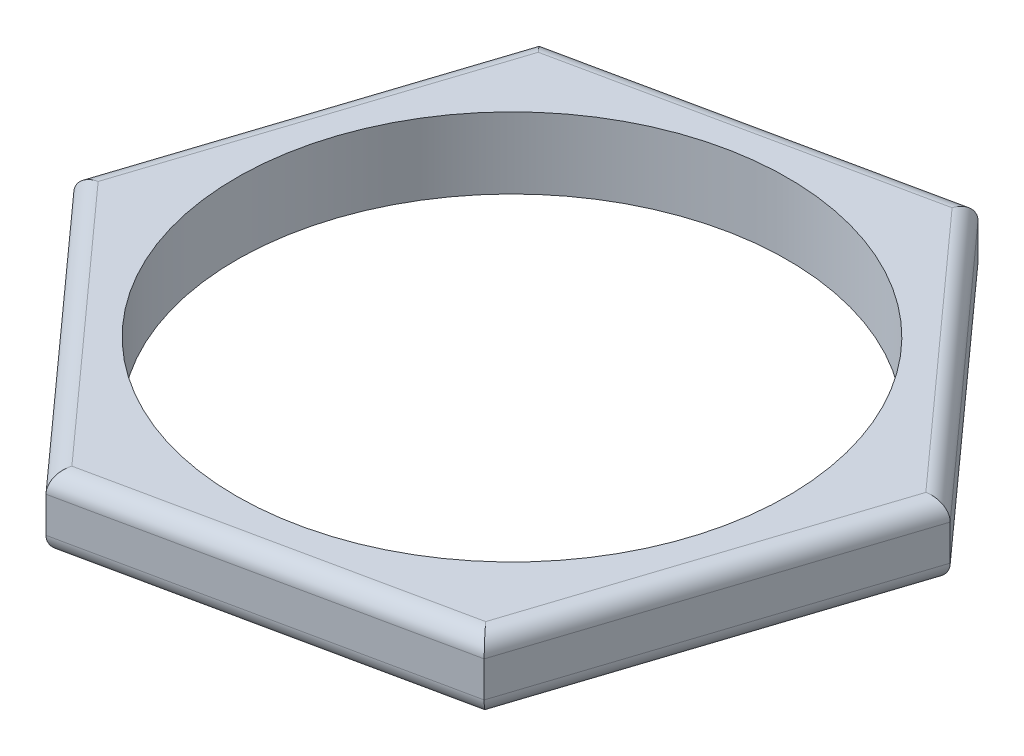
ISO-10303-21;
HEADER;
FILE_DESCRIPTION(('STEP AP214'),'2;1');
FILE_NAME('part.step','',(''),(''),'','','');
FILE_SCHEMA(('AUTOMOTIVE_DESIGN { 1 0 10303 214 1 1 1 1 }'));
ENDSEC;
DATA;
#1=APPLICATION_CONTEXT('core data for automotive mechanical design processes');
#2=APPLICATION_PROTOCOL_DEFINITION('international standard','automotive_design',2000,#1);
#3=PRODUCT_CONTEXT('',#1,'mechanical');
#4=PRODUCT('Part','Part','',(#3));
#5=PRODUCT_RELATED_PRODUCT_CATEGORY('part','',(#4));
#6=PRODUCT_DEFINITION_FORMATION('','',#4);
#7=PRODUCT_DEFINITION_CONTEXT('part definition',#1,'design');
#8=PRODUCT_DEFINITION('design','',#6,#7);
#9=PRODUCT_DEFINITION_SHAPE('','',#8);
#10=(LENGTH_UNIT() NAMED_UNIT(*) SI_UNIT(.MILLI.,.METRE.));
#11=(NAMED_UNIT(*) PLANE_ANGLE_UNIT() SI_UNIT($,.RADIAN.));
#12=(NAMED_UNIT(*) SI_UNIT($,.STERADIAN.) SOLID_ANGLE_UNIT());
#13=UNCERTAINTY_MEASURE_WITH_UNIT(LENGTH_MEASURE(1.E-05),#10,'distance_accuracy_value','');
#14=(GEOMETRIC_REPRESENTATION_CONTEXT(3) GLOBAL_UNCERTAINTY_ASSIGNED_CONTEXT((#13)) GLOBAL_UNIT_ASSIGNED_CONTEXT((#10,
#11,#12)) REPRESENTATION_CONTEXT('',''));
#15=CARTESIAN_POINT('',(0.,0.,0.));
#16=DIRECTION('',(0.,0.,1.));
#17=DIRECTION('',(1.,0.,0.));
#18=AXIS2_PLACEMENT_3D('',#15,#16,#17);
#19=CARTESIAN_POINT('',(0.,4.,0.));
#20=DIRECTION('',(0.,1.,0.));
#21=DIRECTION('',(0.,0.,1.));
#22=AXIS2_PLACEMENT_3D('',#19,#20,#21);
#23=PLANE('',#22);
#24=DIRECTION('',(-0.978322792331729,0.,0.207085764851784));
#25=VECTOR('',#24,1.);
#26=CARTESIAN_POINT('',(-13.6874866976076,4.,-14.4793890721541));
#27=LINE('',#26,#25);
#28=CARTESIAN_POINT('',(6.08173576513986,4.,-18.6640248450422));
#29=VERTEX_POINT('',#28);
#30=CARTESIAN_POINT('',(-13.1226517701005,4.,-14.5989500942366));
#31=VERTEX_POINT('',#30);
#32=EDGE_CURVE('E251',#29,#31,#27,.T.);
#33=ORIENTED_EDGE('',*,*,#32,.T.);
#34=DIRECTION('',(-0.309819863042089,0.,0.950795273686498));
#35=VECTOR('',#34,1.);
#36=CARTESIAN_POINT('',(-19.383262116568,4.,4.61401665801271));
#37=LINE('',#36,#35);
#38=CARTESIAN_POINT('',(-19.2043875352404,4.,4.06507475080559));
#39=VERTEX_POINT('',#38);
#40=EDGE_CURVE('E11',#31,#39,#37,.T.);
#41=ORIENTED_EDGE('',*,*,#40,.T.);
#42=DIRECTION('',(0.66850292928964,0.,0.743709508834713));
#43=VECTOR('',#42,1.);
#44=CARTESIAN_POINT('',(-5.69577541896042,4.,19.0934057301668));
#45=LINE('',#44,#43);
#46=CARTESIAN_POINT('',(-6.08173576513985,4.,18.6640248450422));
#47=VERTEX_POINT('',#46);
#48=EDGE_CURVE('E43',#39,#47,#45,.T.);
#49=ORIENTED_EDGE('',*,*,#48,.T.);
#50=DIRECTION('',(0.978322792331729,0.,-0.207085764851784));
#51=VECTOR('',#50,1.);
#52=CARTESIAN_POINT('',(13.6874866976076,4.,14.4793890721541));
#53=LINE('',#52,#51);
#54=CARTESIAN_POINT('',(13.1226517701005,4.,14.5989500942366));
#55=VERTEX_POINT('',#54);
#56=EDGE_CURVE('E257',#47,#55,#53,.T.);
#57=ORIENTED_EDGE('',*,*,#56,.T.);
#58=DIRECTION('',(0.309819863042089,0.,-0.950795273686497));
#59=VECTOR('',#58,1.);
#60=CARTESIAN_POINT('',(19.383262116568,4.,-4.61401665801271));
#61=LINE('',#60,#59);
#62=CARTESIAN_POINT('',(19.2043875352404,4.,-4.06507475080558));
#63=VERTEX_POINT('',#62);
#64=EDGE_CURVE('E255',#55,#63,#61,.T.);
#65=ORIENTED_EDGE('',*,*,#64,.T.);
#66=DIRECTION('',(-0.66850292928964,0.,-0.743709508834713));
#67=VECTOR('',#66,1.);
#68=CARTESIAN_POINT('',(5.69577541896043,4.,-19.0934057301668));
#69=LINE('',#68,#67);
#70=EDGE_CURVE('E253',#63,#29,#69,.T.);
#71=ORIENTED_EDGE('',*,*,#70,.T.);
#72=EDGE_LOOP('',(#33,#41,#49,#57,#65,#71));
#73=FACE_BOUND('',#72,.T.);
#74=CARTESIAN_POINT('',(0.,4.,0.));
#75=DIRECTION('',(0.,1.,0.));
#76=DIRECTION('',(0.,0.,1.));
#77=AXIS2_PLACEMENT_3D('',#74,#75,#76);
#78=CIRCLE('',#77,15.5);
#79=CARTESIAN_POINT('',(0.,4.,15.5));
#80=VERTEX_POINT('',#79);
#81=EDGE_CURVE('E204',#80,#80,#78,.T.);
#82=ORIENTED_EDGE('',*,*,#81,.F.);
#83=EDGE_LOOP('',(#82));
#84=FACE_BOUND('',#83,.T.);
#85=ADVANCED_FACE('F34',(#73,#84),#23,.T.);
#86=CARTESIAN_POINT('',(0.,0.,0.));
#87=DIRECTION('',(0.,1.,0.));
#88=DIRECTION('',(0.,0.,1.));
#89=AXIS2_PLACEMENT_3D('',#86,#87,#88);
#90=PLANE('',#89);
#91=DIRECTION('',(0.66850292928964,0.,0.743709508834713));
#92=VECTOR('',#91,1.);
#93=CARTESIAN_POINT('',(-12.6430616501901,0.,11.3645497979239));
#94=LINE('',#93,#92);
#95=CARTESIAN_POINT('',(-6.08173576513985,0.,18.6640248450422));
#96=VERTEX_POINT('',#95);
#97=CARTESIAN_POINT('',(-19.2043875352404,0.,4.06507475080558));
#98=VERTEX_POINT('',#97);
#99=EDGE_CURVE('E230',#96,#98,#94,.F.);
#100=ORIENTED_EDGE('',*,*,#99,.T.);
#101=DIRECTION('',(-0.309819863042089,0.,0.950795273686498));
#102=VECTOR('',#101,1.);
#103=CARTESIAN_POINT('',(-16.1635196526704,0.,-5.26693767171551));
#104=LINE('',#103,#102);
#105=CARTESIAN_POINT('',(-13.1226517701005,0.,-14.5989500942366));
#106=VERTEX_POINT('',#105);
#107=EDGE_CURVE('E136',#98,#106,#104,.F.);
#108=ORIENTED_EDGE('',*,*,#107,.T.);
#109=DIRECTION('',(-0.978322792331729,0.,0.207085764851784));
#110=VECTOR('',#109,1.);
#111=CARTESIAN_POINT('',(-3.52045800248033,0.,-16.6314874696394));
#112=LINE('',#111,#110);
#113=CARTESIAN_POINT('',(6.08173576513986,0.,-18.6640248450422));
#114=VERTEX_POINT('',#113);
#115=EDGE_CURVE('E222',#106,#114,#112,.F.);
#116=ORIENTED_EDGE('',*,*,#115,.T.);
#117=DIRECTION('',(-0.66850292928964,0.,-0.743709508834713));
#118=VECTOR('',#117,1.);
#119=CARTESIAN_POINT('',(12.6430616501901,0.,-11.3645497979239));
#120=LINE('',#119,#118);
#121=CARTESIAN_POINT('',(19.2043875352404,0.,-4.06507475080558));
#122=VERTEX_POINT('',#121);
#123=EDGE_CURVE('E224',#114,#122,#120,.F.);
#124=ORIENTED_EDGE('',*,*,#123,.T.);
#125=DIRECTION('',(0.309819863042089,0.,-0.950795273686497));
#126=VECTOR('',#125,1.);
#127=CARTESIAN_POINT('',(16.1635196526705,0.,5.2669376717155));
#128=LINE('',#127,#126);
#129=CARTESIAN_POINT('',(13.1226517701005,0.,14.5989500942366));
#130=VERTEX_POINT('',#129);
#131=EDGE_CURVE('E226',#122,#130,#128,.F.);
#132=ORIENTED_EDGE('',*,*,#131,.T.);
#133=DIRECTION('',(0.978322792331729,0.,-0.207085764851784));
#134=VECTOR('',#133,1.);
#135=CARTESIAN_POINT('',(3.52045800248033,0.,16.6314874696394));
#136=LINE('',#135,#134);
#137=EDGE_CURVE('E228',#130,#96,#136,.F.);
#138=ORIENTED_EDGE('',*,*,#137,.T.);
#139=EDGE_LOOP('',(#100,#108,#116,#124,#132,#138));
#140=FACE_BOUND('',#139,.T.);
#141=CARTESIAN_POINT('',(0.,0.,0.));
#142=DIRECTION('',(0.,1.,0.));
#143=DIRECTION('',(0.,0.,1.));
#144=AXIS2_PLACEMENT_3D('',#141,#142,#143);
#145=CIRCLE('',#144,15.5);
#146=CARTESIAN_POINT('',(0.,0.,15.5));
#147=VERTEX_POINT('',#146);
#148=EDGE_CURVE('E198',#147,#147,#145,.T.);
#149=ORIENTED_EDGE('',*,*,#148,.T.);
#150=EDGE_LOOP('',(#149));
#151=FACE_BOUND('',#150,.T.);
#152=ADVANCED_FACE('F292',(#140,#151),#90,.F.);
#153=CARTESIAN_POINT('',(-6.43948492779514,4.,19.7619086594564));
#154=DIRECTION('',(-0.207085764851784,0.,-0.978322792331729));
#155=DIRECTION('',(-0.978322792331729,0.,0.207085764851784));
#156=AXIS2_PLACEMENT_3D('',#153,#154,#155);
#157=PLANE('',#156);
#158=DIRECTION('',(0.,-1.,0.));
#159=VECTOR('',#158,1.);
#160=CARTESIAN_POINT('',(-6.43948492779514,4.,19.7619086594564));
#161=LINE('',#160,#159);
#162=CARTESIAN_POINT('',(-6.43948492779514,3.,19.7619086594564));
#163=VERTEX_POINT('',#162);
#164=CARTESIAN_POINT('',(-6.43948492779514,1.,19.7619086594564));
#165=VERTEX_POINT('',#164);
#166=EDGE_CURVE('E131',#163,#165,#161,.T.);
#167=ORIENTED_EDGE('',*,*,#166,.T.);
#168=DIRECTION('',(0.978322792331729,0.,-0.207085764851784));
#169=VECTOR('',#168,1.);
#170=CARTESIAN_POINT('',(-6.43948492779514,1.,19.7619086594564));
#171=LINE('',#170,#169);
#172=CARTESIAN_POINT('',(13.8945724624594,1.,15.4577118644858));
#173=VERTEX_POINT('',#172);
#174=EDGE_CURVE('E237',#165,#173,#171,.T.);
#175=ORIENTED_EDGE('',*,*,#174,.T.);
#176=DIRECTION('',(0.,-1.,0.));
#177=VECTOR('',#176,1.);
#178=CARTESIAN_POINT('',(13.8945724624594,4.,15.4577118644858));
#179=LINE('',#178,#177);
#180=CARTESIAN_POINT('',(13.8945724624594,3.,15.4577118644858));
#181=VERTEX_POINT('',#180);
#182=EDGE_CURVE('E153',#181,#173,#179,.T.);
#183=ORIENTED_EDGE('',*,*,#182,.F.);
#184=DIRECTION('',(0.978322792331729,0.,-0.207085764851784));
#185=VECTOR('',#184,1.);
#186=CARTESIAN_POINT('',(-6.43948492779514,3.,19.7619086594564));
#187=LINE('',#186,#185);
#188=EDGE_CURVE('E235',#181,#163,#187,.F.);
#189=ORIENTED_EDGE('',*,*,#188,.T.);
#190=EDGE_LOOP('',(#167,#175,#183,#189));
#191=FACE_BOUND('',#190,.T.);
#192=ADVANCED_FACE('F297',(#191),#157,.F.);
#193=CARTESIAN_POINT('',(13.8945724624594,4.,15.4577118644858));
#194=DIRECTION('',(-0.950795273686497,0.,-0.309819863042089));
#195=DIRECTION('',(-0.309819863042089,0.,0.950795273686497));
#196=AXIS2_PLACEMENT_3D('',#193,#194,#195);
#197=PLANE('',#196);
#198=ORIENTED_EDGE('',*,*,#182,.T.);
#199=DIRECTION('',(0.309819863042089,0.,-0.950795273686497));
#200=VECTOR('',#199,1.);
#201=CARTESIAN_POINT('',(13.8945724624594,1.,15.4577118644858));
#202=LINE('',#201,#200);
#203=CARTESIAN_POINT('',(20.3340573902545,1.,-4.30419679497062));
#204=VERTEX_POINT('',#203);
#205=EDGE_CURVE('E241',#173,#204,#202,.T.);
#206=ORIENTED_EDGE('',*,*,#205,.T.);
#207=DIRECTION('',(0.,-1.,0.));
#208=VECTOR('',#207,1.);
#209=CARTESIAN_POINT('',(20.3340573902545,4.,-4.30419679497062));
#210=LINE('',#209,#208);
#211=CARTESIAN_POINT('',(20.3340573902545,3.,-4.30419679497062));
#212=VERTEX_POINT('',#211);
#213=EDGE_CURVE('E216',#212,#204,#210,.T.);
#214=ORIENTED_EDGE('',*,*,#213,.F.);
#215=DIRECTION('',(0.309819863042089,0.,-0.950795273686497));
#216=VECTOR('',#215,1.);
#217=CARTESIAN_POINT('',(13.8945724624594,3.,15.4577118644858));
#218=LINE('',#217,#216);
#219=EDGE_CURVE('E239',#212,#181,#218,.F.);
#220=ORIENTED_EDGE('',*,*,#219,.T.);
#221=EDGE_LOOP('',(#198,#206,#214,#220));
#222=FACE_BOUND('',#221,.T.);
#223=ADVANCED_FACE('F311',(#222),#197,.F.);
#224=CARTESIAN_POINT('',(20.3340573902545,4.,-4.30419679497062));
#225=DIRECTION('',(-0.743709508834713,0.,0.66850292928964));
#226=DIRECTION('',(0.66850292928964,0.,0.743709508834713));
#227=AXIS2_PLACEMENT_3D('',#224,#225,#226);
#228=PLANE('',#227);
#229=ORIENTED_EDGE('',*,*,#213,.T.);
#230=DIRECTION('',(-0.66850292928964,0.,-0.743709508834713));
#231=VECTOR('',#230,1.);
#232=CARTESIAN_POINT('',(20.3340573902545,1.,-4.30419679497062));
#233=LINE('',#232,#231);
#234=CARTESIAN_POINT('',(6.43948492779514,1.,-19.7619086594564));
#235=VERTEX_POINT('',#234);
#236=EDGE_CURVE('E245',#204,#235,#233,.T.);
#237=ORIENTED_EDGE('',*,*,#236,.T.);
#238=DIRECTION('',(0.,-1.,0.));
#239=VECTOR('',#238,1.);
#240=CARTESIAN_POINT('',(6.43948492779514,4.,-19.7619086594564));
#241=LINE('',#240,#239);
#242=CARTESIAN_POINT('',(6.43948492779514,3.,-19.7619086594564));
#243=VERTEX_POINT('',#242);
#244=EDGE_CURVE('E213',#243,#235,#241,.T.);
#245=ORIENTED_EDGE('',*,*,#244,.F.);
#246=DIRECTION('',(-0.66850292928964,0.,-0.743709508834713));
#247=VECTOR('',#246,1.);
#248=CARTESIAN_POINT('',(20.3340573902545,3.,-4.30419679497062));
#249=LINE('',#248,#247);
#250=EDGE_CURVE('E243',#243,#212,#249,.F.);
#251=ORIENTED_EDGE('',*,*,#250,.T.);
#252=EDGE_LOOP('',(#229,#237,#245,#251));
#253=FACE_BOUND('',#252,.T.);
#254=ADVANCED_FACE('F272',(#253),#228,.F.);
#255=CARTESIAN_POINT('',(6.43948492779514,4.,-19.7619086594564));
#256=DIRECTION('',(0.207085764851784,0.,0.978322792331729));
#257=DIRECTION('',(0.978322792331729,0.,-0.207085764851784));
#258=AXIS2_PLACEMENT_3D('',#255,#256,#257);
#259=PLANE('',#258);
#260=ORIENTED_EDGE('',*,*,#244,.T.);
#261=DIRECTION('',(-0.978322792331729,0.,0.207085764851784));
#262=VECTOR('',#261,1.);
#263=CARTESIAN_POINT('',(6.43948492779514,1.,-19.7619086594564));
#264=LINE('',#263,#262);
#265=CARTESIAN_POINT('',(-13.8945724624594,1.,-15.4577118644858));
#266=VERTEX_POINT('',#265);
#267=EDGE_CURVE('E249',#235,#266,#264,.T.);
#268=ORIENTED_EDGE('',*,*,#267,.T.);
#269=DIRECTION('',(0.,-1.,0.));
#270=VECTOR('',#269,1.);
#271=CARTESIAN_POINT('',(-13.8945724624594,4.,-15.4577118644858));
#272=LINE('',#271,#270);
#273=CARTESIAN_POINT('',(-13.8945724624594,3.,-15.4577118644858));
#274=VERTEX_POINT('',#273);
#275=EDGE_CURVE('E147',#274,#266,#272,.T.);
#276=ORIENTED_EDGE('',*,*,#275,.F.);
#277=DIRECTION('',(-0.978322792331729,0.,0.207085764851784));
#278=VECTOR('',#277,1.);
#279=CARTESIAN_POINT('',(6.43948492779515,3.,-19.7619086594564));
#280=LINE('',#279,#278);
#281=EDGE_CURVE('E247',#274,#243,#280,.F.);
#282=ORIENTED_EDGE('',*,*,#281,.T.);
#283=EDGE_LOOP('',(#260,#268,#276,#282));
#284=FACE_BOUND('',#283,.T.);
#285=ADVANCED_FACE('F269',(#284),#259,.F.);
#286=CARTESIAN_POINT('',(-13.8945724624594,4.,-15.4577118644858));
#287=DIRECTION('',(0.950795273686497,0.,0.309819863042089));
#288=DIRECTION('',(0.309819863042089,0.,-0.950795273686498));
#289=AXIS2_PLACEMENT_3D('',#286,#287,#288);
#290=PLANE('',#289);
#291=ORIENTED_EDGE('',*,*,#275,.T.);
#292=DIRECTION('',(-0.309819863042089,0.,0.950795273686498));
#293=VECTOR('',#292,1.);
#294=CARTESIAN_POINT('',(-13.8945724624594,1.,-15.4577118644858));
#295=LINE('',#294,#293);
#296=CARTESIAN_POINT('',(-20.3340573902545,1.,4.30419679497062));
#297=VERTEX_POINT('',#296);
#298=EDGE_CURVE('E146',#266,#297,#295,.T.);
#299=ORIENTED_EDGE('',*,*,#298,.T.);
#300=DIRECTION('',(0.,-1.,0.));
#301=VECTOR('',#300,1.);
#302=CARTESIAN_POINT('',(-20.3340573902545,4.,4.30419679497062));
#303=LINE('',#302,#301);
#304=CARTESIAN_POINT('',(-20.3340573902545,3.,4.30419679497062));
#305=VERTEX_POINT('',#304);
#306=EDGE_CURVE('E129',#305,#297,#303,.T.);
#307=ORIENTED_EDGE('',*,*,#306,.F.);
#308=DIRECTION('',(-0.309819863042089,0.,0.950795273686498));
#309=VECTOR('',#308,1.);
#310=CARTESIAN_POINT('',(-13.8945724624594,3.,-15.4577118644858));
#311=LINE('',#310,#309);
#312=EDGE_CURVE('E143',#305,#274,#311,.F.);
#313=ORIENTED_EDGE('',*,*,#312,.T.);
#314=EDGE_LOOP('',(#291,#299,#307,#313));
#315=FACE_BOUND('',#314,.T.);
#316=ADVANCED_FACE('F142',(#315),#290,.F.);
#317=CARTESIAN_POINT('',(-20.3340573902545,4.,4.30419679497062));
#318=DIRECTION('',(0.743709508834713,0.,-0.66850292928964));
#319=DIRECTION('',(-0.66850292928964,0.,-0.743709508834713));
#320=AXIS2_PLACEMENT_3D('',#317,#318,#319);
#321=PLANE('',#320);
#322=ORIENTED_EDGE('',*,*,#306,.T.);
#323=DIRECTION('',(0.66850292928964,0.,0.743709508834713));
#324=VECTOR('',#323,1.);
#325=CARTESIAN_POINT('',(-20.3340573902545,1.,4.30419679497062));
#326=LINE('',#325,#324);
#327=EDGE_CURVE('E135',#297,#165,#326,.T.);
#328=ORIENTED_EDGE('',*,*,#327,.T.);
#329=ORIENTED_EDGE('',*,*,#166,.F.);
#330=DIRECTION('',(0.66850292928964,0.,0.743709508834713));
#331=VECTOR('',#330,1.);
#332=CARTESIAN_POINT('',(-20.3340573902545,3.,4.30419679497061));
#333=LINE('',#332,#331);
#334=EDGE_CURVE('E126',#163,#305,#333,.F.);
#335=ORIENTED_EDGE('',*,*,#334,.T.);
#336=EDGE_LOOP('',(#322,#328,#329,#335));
#337=FACE_BOUND('',#336,.T.);
#338=ADVANCED_FACE('F128',(#337),#321,.F.);
#339=CARTESIAN_POINT('',(0.,4.,0.));
#340=DIRECTION('',(0.,-1.,0.));
#341=DIRECTION('',(0.,0.,-1.));
#342=AXIS2_PLACEMENT_3D('',#339,#340,#341);
#343=CYLINDRICAL_SURFACE('',#342,15.5);
#344=ORIENTED_EDGE('',*,*,#81,.T.);
#345=EDGE_LOOP('',(#344));
#346=FACE_BOUND('',#345,.T.);
#347=ORIENTED_EDGE('',*,*,#148,.F.);
#348=EDGE_LOOP('',(#347));
#349=FACE_BOUND('',#348,.T.);
#350=ADVANCED_FACE('F301',(#346,#349),#343,.F.);
#351=CARTESIAN_POINT('',(12.9437771887729,1.,15.1478920014437));
#352=DIRECTION('',(0.309819863042089,0.,-0.950795273686497));
#353=DIRECTION('',(-0.950795273686497,0.,-0.309819863042089));
#354=AXIS2_PLACEMENT_3D('',#351,#352,#353);
#355=CYLINDRICAL_SURFACE('',#354,1.);
#356=CARTESIAN_POINT('',(13.1226517701005,1.,14.5989500942366));
#357=DIRECTION('',(0.743709508834713,0.,-0.668502929289641));
#358=DIRECTION('',(-0.668502929289641,0.,-0.743709508834713));
#359=AXIS2_PLACEMENT_3D('',#356,#357,#358);
#360=ELLIPSE('',#359,1.15470053837925,1.);
#361=EDGE_CURVE('E191',#130,#173,#360,.F.);
#362=ORIENTED_EDGE('',*,*,#361,.F.);
#363=ORIENTED_EDGE('',*,*,#131,.F.);
#364=CARTESIAN_POINT('',(19.2043875352404,1.,-4.06507475080558));
#365=DIRECTION('',(-0.207085764851784,0.,-0.978322792331729));
#366=DIRECTION('',(-0.978322792331729,0.,0.207085764851784));
#367=AXIS2_PLACEMENT_3D('',#364,#365,#366);
#368=ELLIPSE('',#367,1.15470053837925,1.);
#369=EDGE_CURVE('E160',#204,#122,#368,.T.);
#370=ORIENTED_EDGE('',*,*,#369,.F.);
#371=ORIENTED_EDGE('',*,*,#205,.F.);
#372=EDGE_LOOP('',(#362,#363,#370,#371));
#373=FACE_BOUND('',#372,.T.);
#374=ADVANCED_FACE('F325',(#373),#355,.T.);
#375=CARTESIAN_POINT('',(19.5903478814198,1.,-3.63569386568098));
#376=DIRECTION('',(-0.66850292928964,0.,-0.743709508834713));
#377=DIRECTION('',(-0.743709508834713,0.,0.66850292928964));
#378=AXIS2_PLACEMENT_3D('',#375,#376,#377);
#379=CYLINDRICAL_SURFACE('',#378,1.);
#380=ORIENTED_EDGE('',*,*,#369,.T.);
#381=ORIENTED_EDGE('',*,*,#123,.F.);
#382=CARTESIAN_POINT('',(6.08173576513986,1.,-18.6640248450422));
#383=DIRECTION('',(-0.950795273686497,0.,-0.309819863042089));
#384=DIRECTION('',(-0.309819863042089,0.,0.950795273686497));
#385=AXIS2_PLACEMENT_3D('',#382,#383,#384);
#386=ELLIPSE('',#385,1.15470053837925,1.);
#387=EDGE_CURVE('E189',#235,#114,#386,.T.);
#388=ORIENTED_EDGE('',*,*,#387,.F.);
#389=ORIENTED_EDGE('',*,*,#236,.F.);
#390=EDGE_LOOP('',(#380,#381,#388,#389));
#391=FACE_BOUND('',#390,.T.);
#392=ADVANCED_FACE('F274',(#391),#379,.T.);
#393=CARTESIAN_POINT('',(-6.64657069264692,1.,18.7835858671247));
#394=DIRECTION('',(0.978322792331729,0.,-0.207085764851784));
#395=DIRECTION('',(-0.207085764851784,0.,-0.978322792331729));
#396=AXIS2_PLACEMENT_3D('',#393,#394,#395);
#397=CYLINDRICAL_SURFACE('',#396,1.);
#398=ORIENTED_EDGE('',*,*,#361,.T.);
#399=ORIENTED_EDGE('',*,*,#174,.F.);
#400=CARTESIAN_POINT('',(-6.08173576513985,1.,18.6640248450422));
#401=DIRECTION('',(0.950795273686498,0.,0.309819863042089));
#402=DIRECTION('',(0.309819863042089,0.,-0.950795273686497));
#403=AXIS2_PLACEMENT_3D('',#400,#401,#402);
#404=ELLIPSE('',#403,1.15470053837925,1.);
#405=EDGE_CURVE('E183',#96,#165,#404,.F.);
#406=ORIENTED_EDGE('',*,*,#405,.F.);
#407=ORIENTED_EDGE('',*,*,#137,.F.);
#408=EDGE_LOOP('',(#398,#399,#406,#407));
#409=FACE_BOUND('',#408,.T.);
#410=ADVANCED_FACE('F320',(#409),#397,.T.);
#411=CARTESIAN_POINT('',(6.64657069264693,1.,-18.7835858671247));
#412=DIRECTION('',(-0.978322792331729,0.,0.207085764851784));
#413=DIRECTION('',(0.207085764851784,0.,0.978322792331729));
#414=AXIS2_PLACEMENT_3D('',#411,#412,#413);
#415=CYLINDRICAL_SURFACE('',#414,1.);
#416=ORIENTED_EDGE('',*,*,#387,.T.);
#417=ORIENTED_EDGE('',*,*,#115,.F.);
#418=CARTESIAN_POINT('',(-13.1226517701005,1.,-14.5989500942366));
#419=DIRECTION('',(-0.743709508834713,0.,0.66850292928964));
#420=DIRECTION('',(-0.66850292928964,0.,-0.743709508834713));
#421=AXIS2_PLACEMENT_3D('',#418,#419,#420);
#422=ELLIPSE('',#421,1.15470053837925,1.);
#423=EDGE_CURVE('E177',#266,#106,#422,.T.);
#424=ORIENTED_EDGE('',*,*,#423,.F.);
#425=ORIENTED_EDGE('',*,*,#267,.F.);
#426=EDGE_LOOP('',(#416,#417,#424,#425));
#427=FACE_BOUND('',#426,.T.);
#428=ADVANCED_FACE('F279',(#427),#415,.T.);
#429=CARTESIAN_POINT('',(-19.5903478814198,1.,3.63569386568098));
#430=DIRECTION('',(0.66850292928964,0.,0.743709508834713));
#431=DIRECTION('',(0.743709508834713,0.,-0.66850292928964));
#432=AXIS2_PLACEMENT_3D('',#429,#430,#431);
#433=CYLINDRICAL_SURFACE('',#432,1.);
#434=ORIENTED_EDGE('',*,*,#405,.T.);
#435=ORIENTED_EDGE('',*,*,#327,.F.);
#436=CARTESIAN_POINT('',(-19.2043875352404,1.,4.06507475080559));
#437=DIRECTION('',(0.207085764851784,0.,0.978322792331729));
#438=DIRECTION('',(0.978322792331729,0.,-0.207085764851784));
#439=AXIS2_PLACEMENT_3D('',#436,#437,#438);
#440=ELLIPSE('',#439,1.15470053837925,1.);
#441=EDGE_CURVE('E172',#98,#297,#440,.F.);
#442=ORIENTED_EDGE('',*,*,#441,.F.);
#443=ORIENTED_EDGE('',*,*,#99,.F.);
#444=EDGE_LOOP('',(#434,#435,#442,#443));
#445=FACE_BOUND('',#444,.T.);
#446=ADVANCED_FACE('F282',(#445),#433,.T.);
#447=CARTESIAN_POINT('',(-12.9437771887729,1.,-15.1478920014437));
#448=DIRECTION('',(-0.309819863042089,0.,0.950795273686498));
#449=DIRECTION('',(0.950795273686497,0.,0.309819863042089));
#450=AXIS2_PLACEMENT_3D('',#447,#448,#449);
#451=CYLINDRICAL_SURFACE('',#450,1.);
#452=ORIENTED_EDGE('',*,*,#423,.T.);
#453=ORIENTED_EDGE('',*,*,#107,.F.);
#454=ORIENTED_EDGE('',*,*,#441,.T.);
#455=ORIENTED_EDGE('',*,*,#298,.F.);
#456=EDGE_LOOP('',(#452,#453,#454,#455));
#457=FACE_BOUND('',#456,.T.);
#458=ADVANCED_FACE('F280',(#457),#451,.T.);
#459=CARTESIAN_POINT('',(16.1635196526705,3.,5.2669376717155));
#460=DIRECTION('',(-0.309819863042089,0.,0.950795273686497));
#461=DIRECTION('',(0.950795273686497,0.,0.309819863042089));
#462=AXIS2_PLACEMENT_3D('',#459,#460,#461);
#463=CYLINDRICAL_SURFACE('',#462,1.);
#464=CARTESIAN_POINT('',(13.1226517701005,3.,14.5989500942366));
#465=DIRECTION('',(-0.743709508834713,0.,0.668502929289641));
#466=DIRECTION('',(0.668502929289641,0.,0.743709508834713));
#467=AXIS2_PLACEMENT_3D('',#464,#465,#466);
#468=ELLIPSE('',#467,1.15470053837925,1.);
#469=EDGE_CURVE('E166',#181,#55,#468,.T.);
#470=ORIENTED_EDGE('',*,*,#469,.F.);
#471=ORIENTED_EDGE('',*,*,#219,.F.);
#472=CARTESIAN_POINT('',(19.2043875352404,3.,-4.06507475080558));
#473=DIRECTION('',(0.207085764851784,0.,0.978322792331729));
#474=DIRECTION('',(0.978322792331729,0.,-0.207085764851784));
#475=AXIS2_PLACEMENT_3D('',#472,#473,#474);
#476=ELLIPSE('',#475,1.15470053837925,1.);
#477=EDGE_CURVE('E38',#63,#212,#476,.F.);
#478=ORIENTED_EDGE('',*,*,#477,.F.);
#479=ORIENTED_EDGE('',*,*,#64,.F.);
#480=EDGE_LOOP('',(#470,#471,#478,#479));
#481=FACE_BOUND('',#480,.T.);
#482=ADVANCED_FACE('F36',(#481),#463,.T.);
#483=CARTESIAN_POINT('',(12.6430616501901,3.,-11.3645497979239));
#484=DIRECTION('',(0.66850292928964,0.,0.743709508834713));
#485=DIRECTION('',(0.743709508834713,0.,-0.66850292928964));
#486=AXIS2_PLACEMENT_3D('',#483,#484,#485);
#487=CYLINDRICAL_SURFACE('',#486,1.);
#488=ORIENTED_EDGE('',*,*,#477,.T.);
#489=ORIENTED_EDGE('',*,*,#250,.F.);
#490=CARTESIAN_POINT('',(6.08173576513986,3.,-18.6640248450422));
#491=DIRECTION('',(0.950795273686497,0.,0.309819863042089));
#492=DIRECTION('',(0.309819863042089,0.,-0.950795273686497));
#493=AXIS2_PLACEMENT_3D('',#490,#491,#492);
#494=ELLIPSE('',#493,1.15470053837925,1.);
#495=EDGE_CURVE('E164',#29,#243,#494,.F.);
#496=ORIENTED_EDGE('',*,*,#495,.F.);
#497=ORIENTED_EDGE('',*,*,#70,.F.);
#498=EDGE_LOOP('',(#488,#489,#496,#497));
#499=FACE_BOUND('',#498,.T.);
#500=ADVANCED_FACE('F263',(#499),#487,.T.);
#501=CARTESIAN_POINT('',(3.52045800248033,3.,16.6314874696394));
#502=DIRECTION('',(-0.978322792331729,0.,0.207085764851784));
#503=DIRECTION('',(0.207085764851784,0.,0.978322792331729));
#504=AXIS2_PLACEMENT_3D('',#501,#502,#503);
#505=CYLINDRICAL_SURFACE('',#504,1.);
#506=ORIENTED_EDGE('',*,*,#469,.T.);
#507=ORIENTED_EDGE('',*,*,#56,.F.);
#508=CARTESIAN_POINT('',(-6.08173576513985,3.,18.6640248450422));
#509=DIRECTION('',(-0.950795273686498,0.,-0.309819863042089));
#510=DIRECTION('',(-0.309819863042089,0.,0.950795273686497));
#511=AXIS2_PLACEMENT_3D('',#508,#509,#510);
#512=ELLIPSE('',#511,1.15470053837925,1.);
#513=EDGE_CURVE('E157',#163,#47,#512,.T.);
#514=ORIENTED_EDGE('',*,*,#513,.F.);
#515=ORIENTED_EDGE('',*,*,#188,.F.);
#516=EDGE_LOOP('',(#506,#507,#514,#515));
#517=FACE_BOUND('',#516,.T.);
#518=ADVANCED_FACE('F342',(#517),#505,.T.);
#519=CARTESIAN_POINT('',(-3.52045800248033,3.,-16.6314874696394));
#520=DIRECTION('',(0.978322792331729,0.,-0.207085764851784));
#521=DIRECTION('',(-0.207085764851784,0.,-0.978322792331729));
#522=AXIS2_PLACEMENT_3D('',#519,#520,#521);
#523=CYLINDRICAL_SURFACE('',#522,1.);
#524=ORIENTED_EDGE('',*,*,#495,.T.);
#525=ORIENTED_EDGE('',*,*,#281,.F.);
#526=CARTESIAN_POINT('',(-13.1226517701005,3.,-14.5989500942366));
#527=DIRECTION('',(0.743709508834713,0.,-0.66850292928964));
#528=DIRECTION('',(0.66850292928964,0.,0.743709508834713));
#529=AXIS2_PLACEMENT_3D('',#526,#527,#528);
#530=ELLIPSE('',#529,1.15470053837925,1.);
#531=EDGE_CURVE('E151',#31,#274,#530,.F.);
#532=ORIENTED_EDGE('',*,*,#531,.F.);
#533=ORIENTED_EDGE('',*,*,#32,.F.);
#534=EDGE_LOOP('',(#524,#525,#532,#533));
#535=FACE_BOUND('',#534,.T.);
#536=ADVANCED_FACE('F266',(#535),#523,.T.);
#537=CARTESIAN_POINT('',(-12.6430616501901,3.,11.3645497979239));
#538=DIRECTION('',(-0.66850292928964,0.,-0.743709508834713));
#539=DIRECTION('',(-0.743709508834713,0.,0.66850292928964));
#540=AXIS2_PLACEMENT_3D('',#537,#538,#539);
#541=CYLINDRICAL_SURFACE('',#540,1.);
#542=ORIENTED_EDGE('',*,*,#513,.T.);
#543=ORIENTED_EDGE('',*,*,#48,.F.);
#544=CARTESIAN_POINT('',(-19.2043875352404,3.,4.06507475080559));
#545=DIRECTION('',(-0.207085764851784,0.,-0.978322792331729));
#546=DIRECTION('',(-0.978322792331729,0.,0.207085764851784));
#547=AXIS2_PLACEMENT_3D('',#544,#545,#546);
#548=ELLIPSE('',#547,1.15470053837925,1.);
#549=EDGE_CURVE('E51',#305,#39,#548,.T.);
#550=ORIENTED_EDGE('',*,*,#549,.F.);
#551=ORIENTED_EDGE('',*,*,#334,.F.);
#552=EDGE_LOOP('',(#542,#543,#550,#551));
#553=FACE_BOUND('',#552,.T.);
#554=ADVANCED_FACE('F155',(#553),#541,.T.);
#555=CARTESIAN_POINT('',(-16.1635196526704,3.,-5.26693767171551));
#556=DIRECTION('',(0.309819863042089,0.,-0.950795273686498));
#557=DIRECTION('',(-0.950795273686497,0.,-0.309819863042089));
#558=AXIS2_PLACEMENT_3D('',#555,#556,#557);
#559=CYLINDRICAL_SURFACE('',#558,1.);
#560=ORIENTED_EDGE('',*,*,#531,.T.);
#561=ORIENTED_EDGE('',*,*,#312,.F.);
#562=ORIENTED_EDGE('',*,*,#549,.T.);
#563=ORIENTED_EDGE('',*,*,#40,.F.);
#564=EDGE_LOOP('',(#560,#561,#562,#563));
#565=FACE_BOUND('',#564,.T.);
#566=ADVANCED_FACE('F149',(#565),#559,.T.);
#567=CLOSED_SHELL('',(#85,#152,#192,#223,#254,#285,#316,#338,#350,#374,#392,#410,#428,#446,#458,
#482,#500,#518,#536,#554,#566));
#568=MANIFOLD_SOLID_BREP('B2',#567);
#569=ADVANCED_BREP_SHAPE_REPRESENTATION('',(#18,#568),#14);
#570=SHAPE_DEFINITION_REPRESENTATION(#9,#569);
ENDSEC;
END-ISO-10303-21;
